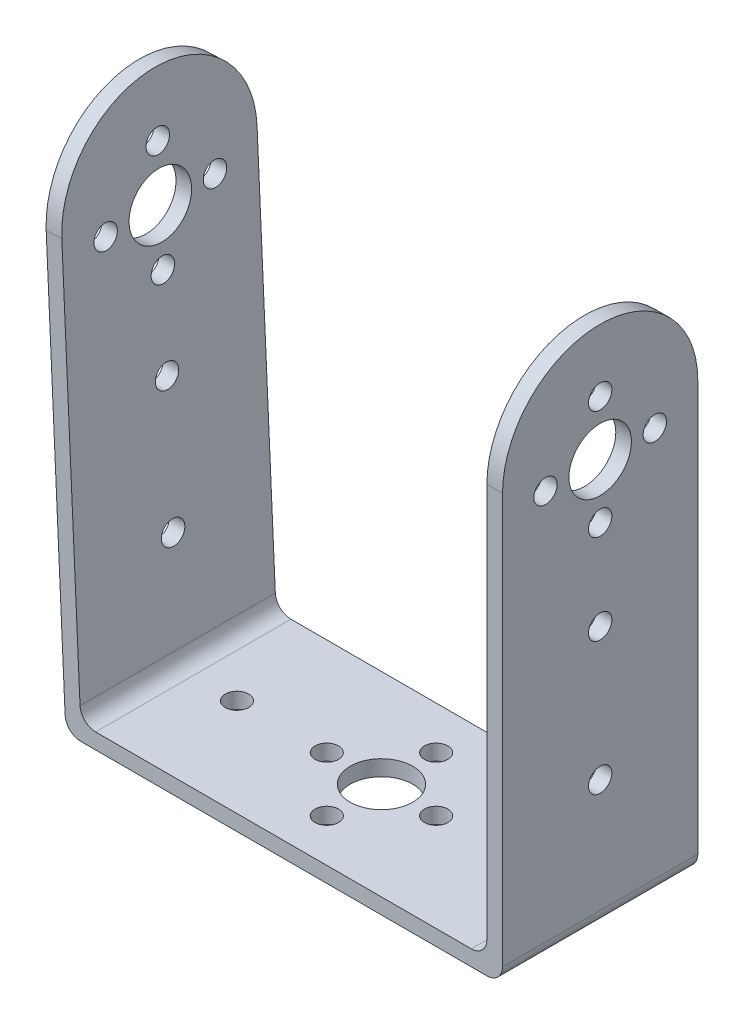
ISO-10303-21;
HEADER;
FILE_DESCRIPTION(('STEP AP214'),'2;1');
FILE_NAME('part.step','',(''),(''),'','','');
FILE_SCHEMA(('AUTOMOTIVE_DESIGN { 1 0 10303 214 1 1 1 1 }'));
ENDSEC;
DATA;
#1=APPLICATION_CONTEXT('core data for automotive mechanical design processes');
#2=APPLICATION_PROTOCOL_DEFINITION('international standard','automotive_design',2000,#1);
#3=PRODUCT_CONTEXT('',#1,'mechanical');
#4=PRODUCT('Part','Part','',(#3));
#5=PRODUCT_RELATED_PRODUCT_CATEGORY('part','',(#4));
#6=PRODUCT_DEFINITION_FORMATION('','',#4);
#7=PRODUCT_DEFINITION_CONTEXT('part definition',#1,'design');
#8=PRODUCT_DEFINITION('design','',#6,#7);
#9=PRODUCT_DEFINITION_SHAPE('','',#8);
#10=(LENGTH_UNIT() NAMED_UNIT(*) SI_UNIT(.MILLI.,.METRE.));
#11=(NAMED_UNIT(*) PLANE_ANGLE_UNIT() SI_UNIT($,.RADIAN.));
#12=(NAMED_UNIT(*) SI_UNIT($,.STERADIAN.) SOLID_ANGLE_UNIT());
#13=UNCERTAINTY_MEASURE_WITH_UNIT(LENGTH_MEASURE(1.E-05),#10,'distance_accuracy_value','');
#14=(GEOMETRIC_REPRESENTATION_CONTEXT(3) GLOBAL_UNCERTAINTY_ASSIGNED_CONTEXT((#13)) GLOBAL_UNIT_ASSIGNED_CONTEXT((#10,
#11,#12)) REPRESENTATION_CONTEXT('',''));
#15=CARTESIAN_POINT('',(0.,0.,0.));
#16=DIRECTION('',(0.,0.,1.));
#17=DIRECTION('',(1.,0.,0.));
#18=AXIS2_PLACEMENT_3D('',#15,#16,#17);
#19=CARTESIAN_POINT('',(25.999082785568,67.0000000000004,-25.));
#20=DIRECTION('',(-1.,0.,0.));
#21=DIRECTION('',(0.,-1.,0.));
#22=AXIS2_PLACEMENT_3D('',#19,#20,#21);
#23=PLANE('',#22);
#24=CARTESIAN_POINT('',(25.999082785568,52.,-5.5));
#25=DIRECTION('',(1.,0.,0.));
#26=DIRECTION('',(0.,0.,-1.));
#27=AXIS2_PLACEMENT_3D('',#24,#25,#26);
#28=CIRCLE('',#27,1.5);
#29=CARTESIAN_POINT('',(25.999082785568,52.,-7.));
#30=VERTEX_POINT('',#29);
#31=EDGE_CURVE('E625',#30,#30,#28,.T.);
#32=ORIENTED_EDGE('',*,*,#31,.T.);
#33=EDGE_LOOP('',(#32));
#34=FACE_BOUND('',#33,.T.);
#35=CARTESIAN_POINT('',(25.999082785568,33.5,-12.5));
#36=DIRECTION('',(1.,0.,0.));
#37=DIRECTION('',(0.,0.,-1.));
#38=AXIS2_PLACEMENT_3D('',#35,#36,#37);
#39=CIRCLE('',#38,1.5);
#40=CARTESIAN_POINT('',(25.999082785568,33.5,-14.));
#41=VERTEX_POINT('',#40);
#42=EDGE_CURVE('E631',#41,#41,#39,.T.);
#43=ORIENTED_EDGE('',*,*,#42,.T.);
#44=EDGE_LOOP('',(#43));
#45=FACE_BOUND('',#44,.T.);
#46=CARTESIAN_POINT('',(25.999082785568,16.5,-12.5));
#47=DIRECTION('',(1.,0.,0.));
#48=DIRECTION('',(0.,0.,-1.));
#49=AXIS2_PLACEMENT_3D('',#46,#47,#48);
#50=CIRCLE('',#49,1.5);
#51=CARTESIAN_POINT('',(25.999082785568,16.5,-14.));
#52=VERTEX_POINT('',#51);
#53=EDGE_CURVE('E613',#52,#52,#50,.T.);
#54=ORIENTED_EDGE('',*,*,#53,.T.);
#55=EDGE_LOOP('',(#54));
#56=FACE_BOUND('',#55,.T.);
#57=CARTESIAN_POINT('',(25.999082785568,52.,-12.5));
#58=DIRECTION('',(1.,0.,0.));
#59=DIRECTION('',(0.,0.,-1.));
#60=AXIS2_PLACEMENT_3D('',#57,#58,#59);
#61=CIRCLE('',#60,4.);
#62=CARTESIAN_POINT('',(25.999082785568,52.,-16.5));
#63=VERTEX_POINT('',#62);
#64=EDGE_CURVE('E620',#63,#63,#61,.T.);
#65=ORIENTED_EDGE('',*,*,#64,.T.);
#66=EDGE_LOOP('',(#65));
#67=FACE_BOUND('',#66,.T.);
#68=CARTESIAN_POINT('',(25.999082785568,45.,-12.4999999999999));
#69=DIRECTION('',(1.,0.,0.));
#70=DIRECTION('',(0.,0.,-1.));
#71=AXIS2_PLACEMENT_3D('',#68,#69,#70);
#72=CIRCLE('',#71,1.5);
#73=CARTESIAN_POINT('',(25.999082785568,45.,-13.9999999999999));
#74=VERTEX_POINT('',#73);
#75=EDGE_CURVE('E647',#74,#74,#72,.T.);
#76=ORIENTED_EDGE('',*,*,#75,.T.);
#77=EDGE_LOOP('',(#76));
#78=FACE_BOUND('',#77,.T.);
#79=CARTESIAN_POINT('',(25.999082785568,52.,-19.5));
#80=DIRECTION('',(1.,0.,0.));
#81=DIRECTION('',(0.,0.,-1.));
#82=AXIS2_PLACEMENT_3D('',#79,#80,#81);
#83=CIRCLE('',#82,1.5);
#84=CARTESIAN_POINT('',(25.999082785568,52.,-21.));
#85=VERTEX_POINT('',#84);
#86=EDGE_CURVE('E640',#85,#85,#83,.T.);
#87=ORIENTED_EDGE('',*,*,#86,.T.);
#88=EDGE_LOOP('',(#87));
#89=FACE_BOUND('',#88,.T.);
#90=CARTESIAN_POINT('',(25.999082785568,59.,-12.5));
#91=DIRECTION('',(1.,0.,0.));
#92=DIRECTION('',(0.,0.,-1.));
#93=AXIS2_PLACEMENT_3D('',#90,#91,#92);
#94=CIRCLE('',#93,1.5);
#95=CARTESIAN_POINT('',(25.999082785568,59.,-14.));
#96=VERTEX_POINT('',#95);
#97=EDGE_CURVE('E259',#96,#96,#94,.T.);
#98=ORIENTED_EDGE('',*,*,#97,.T.);
#99=EDGE_LOOP('',(#98));
#100=FACE_BOUND('',#99,.T.);
#101=DIRECTION('',(0.,-1.,0.));
#102=VECTOR('',#101,1.);
#103=CARTESIAN_POINT('',(25.999082785568,67.0000000000004,-25.));
#104=LINE('',#103,#102);
#105=CARTESIAN_POINT('',(25.999082785568,54.5,-25.));
#106=VERTEX_POINT('',#105);
#107=CARTESIAN_POINT('',(25.999082785568,4.,-25.));
#108=VERTEX_POINT('',#107);
#109=EDGE_CURVE('E243',#106,#108,#104,.T.);
#110=ORIENTED_EDGE('',*,*,#109,.T.);
#111=DIRECTION('',(0.,0.,1.));
#112=VECTOR('',#111,1.);
#113=CARTESIAN_POINT('',(25.999082785568,4.,0.));
#114=LINE('',#113,#112);
#115=CARTESIAN_POINT('',(25.999082785568,4.,0.));
#116=VERTEX_POINT('',#115);
#117=EDGE_CURVE('E314',#108,#116,#114,.T.);
#118=ORIENTED_EDGE('',*,*,#117,.T.);
#119=DIRECTION('',(0.,-1.,0.));
#120=VECTOR('',#119,1.);
#121=CARTESIAN_POINT('',(25.999082785568,67.0000000000004,0.));
#122=LINE('',#121,#120);
#123=CARTESIAN_POINT('',(25.999082785568,54.5,0.));
#124=VERTEX_POINT('',#123);
#125=EDGE_CURVE('E246',#124,#116,#122,.T.);
#126=ORIENTED_EDGE('',*,*,#125,.F.);
#127=CARTESIAN_POINT('',(25.999082785568,54.5,-12.5));
#128=DIRECTION('',(1.,0.,0.));
#129=DIRECTION('',(0.,0.,-1.));
#130=AXIS2_PLACEMENT_3D('',#127,#128,#129);
#131=CIRCLE('',#130,12.5);
#132=EDGE_CURVE('E239',#106,#124,#131,.T.);
#133=ORIENTED_EDGE('',*,*,#132,.F.);
#134=EDGE_LOOP('',(#110,#118,#126,#133));
#135=FACE_BOUND('',#134,.T.);
#136=ADVANCED_FACE('F149',(#34,#45,#56,#67,#78,#89,#100,#135),#23,.T.);
#137=CARTESIAN_POINT('',(27.999082785568,67.,-25.));
#138=DIRECTION('',(1.,0.,0.));
#139=DIRECTION('',(0.,0.,-1.));
#140=AXIS2_PLACEMENT_3D('',#137,#138,#139);
#141=PLANE('',#140);
#142=CARTESIAN_POINT('',(27.999082785568,52.,-5.5));
#143=DIRECTION('',(1.,0.,0.));
#144=DIRECTION('',(0.,0.,-1.));
#145=AXIS2_PLACEMENT_3D('',#142,#143,#144);
#146=CIRCLE('',#145,1.5);
#147=CARTESIAN_POINT('',(27.999082785568,52.,-7.));
#148=VERTEX_POINT('',#147);
#149=EDGE_CURVE('E628',#148,#148,#146,.T.);
#150=ORIENTED_EDGE('',*,*,#149,.F.);
#151=EDGE_LOOP('',(#150));
#152=FACE_BOUND('',#151,.T.);
#153=CARTESIAN_POINT('',(27.999082785568,33.5,-12.5));
#154=DIRECTION('',(1.,0.,0.));
#155=DIRECTION('',(0.,0.,-1.));
#156=AXIS2_PLACEMENT_3D('',#153,#154,#155);
#157=CIRCLE('',#156,1.5);
#158=CARTESIAN_POINT('',(27.999082785568,33.5,-14.));
#159=VERTEX_POINT('',#158);
#160=EDGE_CURVE('E616',#159,#159,#157,.T.);
#161=ORIENTED_EDGE('',*,*,#160,.F.);
#162=EDGE_LOOP('',(#161));
#163=FACE_BOUND('',#162,.T.);
#164=CARTESIAN_POINT('',(27.999082785568,16.5,-12.5));
#165=DIRECTION('',(1.,0.,0.));
#166=DIRECTION('',(0.,0.,-1.));
#167=AXIS2_PLACEMENT_3D('',#164,#165,#166);
#168=CIRCLE('',#167,1.5);
#169=CARTESIAN_POINT('',(27.999082785568,16.5,-14.));
#170=VERTEX_POINT('',#169);
#171=EDGE_CURVE('E617',#170,#170,#168,.T.);
#172=ORIENTED_EDGE('',*,*,#171,.F.);
#173=EDGE_LOOP('',(#172));
#174=FACE_BOUND('',#173,.T.);
#175=CARTESIAN_POINT('',(27.999082785568,52.,-12.5));
#176=DIRECTION('',(1.,0.,0.));
#177=DIRECTION('',(0.,0.,-1.));
#178=AXIS2_PLACEMENT_3D('',#175,#176,#177);
#179=CIRCLE('',#178,4.);
#180=CARTESIAN_POINT('',(27.999082785568,52.,-16.5));
#181=VERTEX_POINT('',#180);
#182=EDGE_CURVE('E610',#181,#181,#179,.T.);
#183=ORIENTED_EDGE('',*,*,#182,.F.);
#184=EDGE_LOOP('',(#183));
#185=FACE_BOUND('',#184,.T.);
#186=CARTESIAN_POINT('',(27.999082785568,45.,-12.4999999999999));
#187=DIRECTION('',(1.,0.,0.));
#188=DIRECTION('',(0.,0.,-1.));
#189=AXIS2_PLACEMENT_3D('',#186,#187,#188);
#190=CIRCLE('',#189,1.5);
#191=CARTESIAN_POINT('',(27.999082785568,45.,-13.9999999999999));
#192=VERTEX_POINT('',#191);
#193=EDGE_CURVE('E627',#192,#192,#190,.T.);
#194=ORIENTED_EDGE('',*,*,#193,.F.);
#195=EDGE_LOOP('',(#194));
#196=FACE_BOUND('',#195,.T.);
#197=CARTESIAN_POINT('',(27.999082785568,52.,-19.5));
#198=DIRECTION('',(1.,0.,0.));
#199=DIRECTION('',(0.,0.,-1.));
#200=AXIS2_PLACEMENT_3D('',#197,#198,#199);
#201=CIRCLE('',#200,1.5);
#202=CARTESIAN_POINT('',(27.999082785568,52.,-21.));
#203=VERTEX_POINT('',#202);
#204=EDGE_CURVE('E644',#203,#203,#201,.T.);
#205=ORIENTED_EDGE('',*,*,#204,.F.);
#206=EDGE_LOOP('',(#205));
#207=FACE_BOUND('',#206,.T.);
#208=CARTESIAN_POINT('',(27.999082785568,59.,-12.5));
#209=DIRECTION('',(1.,0.,0.));
#210=DIRECTION('',(0.,0.,-1.));
#211=AXIS2_PLACEMENT_3D('',#208,#209,#210);
#212=CIRCLE('',#211,1.5);
#213=CARTESIAN_POINT('',(27.999082785568,59.,-14.));
#214=VERTEX_POINT('',#213);
#215=EDGE_CURVE('E638',#214,#214,#212,.T.);
#216=ORIENTED_EDGE('',*,*,#215,.F.);
#217=EDGE_LOOP('',(#216));
#218=FACE_BOUND('',#217,.T.);
#219=DIRECTION('',(0.,1.,0.));
#220=VECTOR('',#219,1.);
#221=CARTESIAN_POINT('',(27.999082785568,67.,0.));
#222=LINE('',#221,#220);
#223=CARTESIAN_POINT('',(27.999082785568,2.,0.));
#224=VERTEX_POINT('',#223);
#225=CARTESIAN_POINT('',(27.999082785568,54.5,0.));
#226=VERTEX_POINT('',#225);
#227=EDGE_CURVE('E281',#224,#226,#222,.T.);
#228=ORIENTED_EDGE('',*,*,#227,.F.);
#229=DIRECTION('',(0.,0.,1.));
#230=VECTOR('',#229,1.);
#231=CARTESIAN_POINT('',(27.999082785568,2.,-25.));
#232=LINE('',#231,#230);
#233=CARTESIAN_POINT('',(27.999082785568,2.,-25.));
#234=VERTEX_POINT('',#233);
#235=EDGE_CURVE('E316',#224,#234,#232,.F.);
#236=ORIENTED_EDGE('',*,*,#235,.T.);
#237=DIRECTION('',(0.,1.,0.));
#238=VECTOR('',#237,1.);
#239=CARTESIAN_POINT('',(27.999082785568,67.,-25.));
#240=LINE('',#239,#238);
#241=CARTESIAN_POINT('',(27.999082785568,54.5,-25.));
#242=VERTEX_POINT('',#241);
#243=EDGE_CURVE('E265',#234,#242,#240,.T.);
#244=ORIENTED_EDGE('',*,*,#243,.T.);
#245=CARTESIAN_POINT('',(27.999082785568,54.5,-12.5));
#246=DIRECTION('',(1.,0.,0.));
#247=DIRECTION('',(0.,0.,-1.));
#248=AXIS2_PLACEMENT_3D('',#245,#246,#247);
#249=CIRCLE('',#248,12.5);
#250=EDGE_CURVE('E251',#242,#226,#249,.T.);
#251=ORIENTED_EDGE('',*,*,#250,.T.);
#252=EDGE_LOOP('',(#228,#236,#244,#251));
#253=FACE_BOUND('',#252,.T.);
#254=ADVANCED_FACE('F337',(#152,#163,#174,#185,#196,#207,#218,#253),#141,.T.);
#255=CARTESIAN_POINT('',(0.,0.,-25.));
#256=DIRECTION('',(0.,0.,-1.));
#257=DIRECTION('',(-1.,0.,0.));
#258=AXIS2_PLACEMENT_3D('',#255,#256,#257);
#259=PLANE('',#258);
#260=DIRECTION('',(1.,0.,0.));
#261=VECTOR('',#260,1.);
#262=CARTESIAN_POINT('',(-27.9107385664314,0.,-25.));
#263=LINE('',#262,#261);
#264=CARTESIAN_POINT('',(-26.0009172144317,0.,-25.));
#265=VERTEX_POINT('',#264);
#266=CARTESIAN_POINT('',(25.999082785568,1.32373910591952E-13,-25.));
#267=VERTEX_POINT('',#266);
#268=EDGE_CURVE('E269',#265,#267,#263,.T.);
#269=ORIENTED_EDGE('',*,*,#268,.F.);
#270=CARTESIAN_POINT('',(-26.0009172144317,2.,-25.));
#271=DIRECTION('',(0.,0.,-1.));
#272=DIRECTION('',(-1.,0.,0.));
#273=AXIS2_PLACEMENT_3D('',#270,#271,#272);
#274=CIRCLE('',#273,2.);
#275=CARTESIAN_POINT('',(-27.9987904341291,1.90779046678319,-25.));
#276=VERTEX_POINT('',#275);
#277=EDGE_CURVE('E306',#265,#276,#274,.T.);
#278=ORIENTED_EDGE('',*,*,#277,.T.);
#279=DIRECTION('',(0.0461047666084067,-0.998936609848685,0.));
#280=VECTOR('',#279,1.);
#281=CARTESIAN_POINT('',(-30.9987904341294,66.9077904667816,-25.));
#282=LINE('',#281,#280);
#283=CARTESIAN_POINT('',(-30.4224808515243,54.4210828436731,-25.));
#284=VERTEX_POINT('',#283);
#285=EDGE_CURVE('E274',#284,#276,#282,.T.);
#286=ORIENTED_EDGE('',*,*,#285,.F.);
#287=DIRECTION('',(-0.998936609848685,-0.0461047666084067,0.));
#288=VECTOR('',#287,1.);
#289=CARTESIAN_POINT('',(-28.424607631827,54.5132923768899,-25.));
#290=LINE('',#289,#288);
#291=CARTESIAN_POINT('',(-28.424607631827,54.5132923768899,-25.));
#292=VERTEX_POINT('',#291);
#293=EDGE_CURVE('E379',#292,#284,#290,.T.);
#294=ORIENTED_EDGE('',*,*,#293,.F.);
#295=DIRECTION('',(-0.0461047666084023,0.998936609848685,0.));
#296=VECTOR('',#295,1.);
#297=CARTESIAN_POINT('',(-26.000917214432,1.99999999999999,-25.));
#298=LINE('',#297,#296);
#299=CARTESIAN_POINT('',(-26.0889690821297,3.90779046678319,-25.));
#300=VERTEX_POINT('',#299);
#301=EDGE_CURVE('E267',#300,#292,#298,.T.);
#302=ORIENTED_EDGE('',*,*,#301,.F.);
#303=CARTESIAN_POINT('',(-24.0910958624323,3.99999999999999,-25.));
#304=DIRECTION('',(0.,0.,-1.));
#305=DIRECTION('',(-1.,0.,0.));
#306=AXIS2_PLACEMENT_3D('',#303,#304,#305);
#307=CIRCLE('',#306,2.);
#308=CARTESIAN_POINT('',(-24.0910958624323,1.99999999999999,-25.));
#309=VERTEX_POINT('',#308);
#310=EDGE_CURVE('E164',#300,#309,#307,.F.);
#311=ORIENTED_EDGE('',*,*,#310,.T.);
#312=DIRECTION('',(-1.,0.,0.));
#313=VECTOR('',#312,1.);
#314=CARTESIAN_POINT('',(25.999082785568,2.,-25.));
#315=LINE('',#314,#313);
#316=CARTESIAN_POINT('',(23.999082785568,2.,-25.));
#317=VERTEX_POINT('',#316);
#318=EDGE_CURVE('E264',#317,#309,#315,.T.);
#319=ORIENTED_EDGE('',*,*,#318,.F.);
#320=CARTESIAN_POINT('',(23.999082785568,4.,-25.));
#321=DIRECTION('',(0.,0.,-1.));
#322=DIRECTION('',(-1.,0.,0.));
#323=AXIS2_PLACEMENT_3D('',#320,#321,#322);
#324=CIRCLE('',#323,2.);
#325=EDGE_CURVE('E12',#317,#108,#324,.F.);
#326=ORIENTED_EDGE('',*,*,#325,.T.);
#327=ORIENTED_EDGE('',*,*,#109,.F.);
#328=DIRECTION('',(1.,0.,0.));
#329=VECTOR('',#328,1.);
#330=CARTESIAN_POINT('',(25.999082785568,54.5,-25.));
#331=LINE('',#330,#329);
#332=EDGE_CURVE('E255',#106,#242,#331,.T.);
#333=ORIENTED_EDGE('',*,*,#332,.T.);
#334=ORIENTED_EDGE('',*,*,#243,.F.);
#335=CARTESIAN_POINT('',(25.999082785568,2.,-25.));
#336=DIRECTION('',(0.,0.,-1.));
#337=DIRECTION('',(-1.,0.,0.));
#338=AXIS2_PLACEMENT_3D('',#335,#336,#337);
#339=CIRCLE('',#338,2.);
#340=EDGE_CURVE('E304',#234,#267,#339,.T.);
#341=ORIENTED_EDGE('',*,*,#340,.T.);
#342=EDGE_LOOP('',(#269,#278,#286,#294,#302,#311,#319,#326,#327,#333,#334,#341));
#343=FACE_BOUND('',#342,.T.);
#344=ADVANCED_FACE('F262',(#343),#259,.T.);
#345=CARTESIAN_POINT('',(0.,0.,0.));
#346=DIRECTION('',(0.,0.,-1.));
#347=DIRECTION('',(-1.,0.,0.));
#348=AXIS2_PLACEMENT_3D('',#345,#346,#347);
#349=PLANE('',#348);
#350=DIRECTION('',(0.0461047666084067,-0.998936609848685,0.));
#351=VECTOR('',#350,1.);
#352=CARTESIAN_POINT('',(-30.9987904341294,66.9077904667816,0.));
#353=LINE('',#352,#351);
#354=CARTESIAN_POINT('',(-30.4224808515243,54.4210828436731,0.));
#355=VERTEX_POINT('',#354);
#356=CARTESIAN_POINT('',(-27.9987904341291,1.90779046678319,0.));
#357=VERTEX_POINT('',#356);
#358=EDGE_CURVE('E290',#355,#357,#353,.T.);
#359=ORIENTED_EDGE('',*,*,#358,.T.);
#360=CARTESIAN_POINT('',(-26.0009172144317,2.,0.));
#361=DIRECTION('',(0.,0.,-1.));
#362=DIRECTION('',(-1.,0.,0.));
#363=AXIS2_PLACEMENT_3D('',#360,#361,#362);
#364=CIRCLE('',#363,2.);
#365=CARTESIAN_POINT('',(-26.0009172144317,0.,0.));
#366=VERTEX_POINT('',#365);
#367=EDGE_CURVE('E297',#357,#366,#364,.F.);
#368=ORIENTED_EDGE('',*,*,#367,.T.);
#369=DIRECTION('',(1.,0.,0.));
#370=VECTOR('',#369,1.);
#371=CARTESIAN_POINT('',(27.999082785568,0.,0.));
#372=LINE('',#371,#370);
#373=CARTESIAN_POINT('',(25.999082785568,0.,0.));
#374=VERTEX_POINT('',#373);
#375=EDGE_CURVE('E278',#366,#374,#372,.T.);
#376=ORIENTED_EDGE('',*,*,#375,.T.);
#377=CARTESIAN_POINT('',(25.999082785568,2.,0.));
#378=DIRECTION('',(0.,0.,-1.));
#379=DIRECTION('',(-1.,0.,0.));
#380=AXIS2_PLACEMENT_3D('',#377,#378,#379);
#381=CIRCLE('',#380,2.);
#382=EDGE_CURVE('E295',#374,#224,#381,.F.);
#383=ORIENTED_EDGE('',*,*,#382,.T.);
#384=ORIENTED_EDGE('',*,*,#227,.T.);
#385=DIRECTION('',(1.,0.,0.));
#386=VECTOR('',#385,1.);
#387=CARTESIAN_POINT('',(25.999082785568,54.5,0.));
#388=LINE('',#387,#386);
#389=EDGE_CURVE('E250',#124,#226,#388,.T.);
#390=ORIENTED_EDGE('',*,*,#389,.F.);
#391=ORIENTED_EDGE('',*,*,#125,.T.);
#392=CARTESIAN_POINT('',(23.999082785568,4.,0.));
#393=DIRECTION('',(0.,0.,-1.));
#394=DIRECTION('',(-1.,0.,0.));
#395=AXIS2_PLACEMENT_3D('',#392,#393,#394);
#396=CIRCLE('',#395,2.);
#397=CARTESIAN_POINT('',(23.999082785568,2.,0.));
#398=VERTEX_POINT('',#397);
#399=EDGE_CURVE('E157',#116,#398,#396,.T.);
#400=ORIENTED_EDGE('',*,*,#399,.T.);
#401=DIRECTION('',(-1.,0.,0.));
#402=VECTOR('',#401,1.);
#403=CARTESIAN_POINT('',(25.999082785568,2.,0.));
#404=LINE('',#403,#402);
#405=CARTESIAN_POINT('',(-24.0910958624323,1.99999999999999,0.));
#406=VERTEX_POINT('',#405);
#407=EDGE_CURVE('E285',#398,#406,#404,.T.);
#408=ORIENTED_EDGE('',*,*,#407,.T.);
#409=CARTESIAN_POINT('',(-24.0910958624323,3.99999999999999,0.));
#410=DIRECTION('',(0.,0.,-1.));
#411=DIRECTION('',(-1.,0.,0.));
#412=AXIS2_PLACEMENT_3D('',#409,#410,#411);
#413=CIRCLE('',#412,2.);
#414=CARTESIAN_POINT('',(-26.0889690821297,3.90779046678319,0.));
#415=VERTEX_POINT('',#414);
#416=EDGE_CURVE('E318',#406,#415,#413,.T.);
#417=ORIENTED_EDGE('',*,*,#416,.T.);
#418=DIRECTION('',(-0.0461047666084023,0.998936609848685,0.));
#419=VECTOR('',#418,1.);
#420=CARTESIAN_POINT('',(-26.000917214432,1.99999999999999,0.));
#421=LINE('',#420,#419);
#422=CARTESIAN_POINT('',(-28.424607631827,54.5132923768899,0.));
#423=VERTEX_POINT('',#422);
#424=EDGE_CURVE('E288',#415,#423,#421,.T.);
#425=ORIENTED_EDGE('',*,*,#424,.T.);
#426=DIRECTION('',(-0.998936609848685,-0.0461047666084067,0.));
#427=VECTOR('',#426,1.);
#428=CARTESIAN_POINT('',(-28.424607631827,54.5132923768899,0.));
#429=LINE('',#428,#427);
#430=EDGE_CURVE('E282',#423,#355,#429,.T.);
#431=ORIENTED_EDGE('',*,*,#430,.T.);
#432=EDGE_LOOP('',(#359,#368,#376,#383,#384,#390,#391,#400,#408,#417,#425,#431));
#433=FACE_BOUND('',#432,.T.);
#434=ADVANCED_FACE('F321',(#433),#349,.F.);
#435=CARTESIAN_POINT('',(-30.9987904341294,66.9077904667816,-25.));
#436=DIRECTION('',(-0.998936609848685,-0.0461047666084067,0.));
#437=DIRECTION('',(0.0461047666084067,-0.998936609848685,0.));
#438=AXIS2_PLACEMENT_3D('',#435,#436,#437);
#439=PLANE('',#438);
#440=CARTESIAN_POINT('',(-30.6309197963274,58.9372599810724,-12.4999999999999));
#441=DIRECTION('',(-0.998936609848685,-0.0461047666084067,0.));
#442=DIRECTION('',(0.0461047666084067,-0.998936609848685,0.));
#443=AXIS2_PLACEMENT_3D('',#440,#441,#442);
#444=CIRCLE('',#443,1.5);
#445=CARTESIAN_POINT('',(-30.5617626464148,57.4388550662994,-12.4999999999999));
#446=VERTEX_POINT('',#445);
#447=EDGE_CURVE('E406',#446,#446,#444,.T.);
#448=ORIENTED_EDGE('',*,*,#447,.F.);
#449=EDGE_LOOP('',(#448));
#450=FACE_BOUND('',#449,.T.);
#451=CARTESIAN_POINT('',(-30.3081864300686,51.9447037121315,-5.50000000000001));
#452=DIRECTION('',(-0.998936609848685,-0.0461047666084067,0.));
#453=DIRECTION('',(0.0461047666084067,-0.998936609848685,0.));
#454=AXIS2_PLACEMENT_3D('',#451,#452,#453);
#455=CIRCLE('',#454,1.5);
#456=CARTESIAN_POINT('',(-30.2390292801559,50.4462987973585,-5.50000000000001));
#457=VERTEX_POINT('',#456);
#458=EDGE_CURVE('E435',#457,#457,#455,.T.);
#459=ORIENTED_EDGE('',*,*,#458,.F.);
#460=EDGE_LOOP('',(#459));
#461=FACE_BOUND('',#460,.T.);
#462=CARTESIAN_POINT('',(-30.3081864300685,51.9447037121316,-12.5));
#463=DIRECTION('',(-0.998936609848685,-0.0461047666084067,0.));
#464=DIRECTION('',(0.0461047666084067,-0.998936609848685,0.));
#465=AXIS2_PLACEMENT_3D('',#462,#463,#464);
#466=CIRCLE('',#465,4.);
#467=CARTESIAN_POINT('',(-30.1237673636349,47.9489572727369,-12.5));
#468=VERTEX_POINT('',#467);
#469=EDGE_CURVE('E420',#468,#468,#466,.T.);
#470=ORIENTED_EDGE('',*,*,#469,.F.);
#471=EDGE_LOOP('',(#470));
#472=FACE_BOUND('',#471,.T.);
#473=CARTESIAN_POINT('',(-30.3081864300685,51.9447037121316,-19.5));
#474=DIRECTION('',(-0.998936609848685,-0.0461047666084067,0.));
#475=DIRECTION('',(0.0461047666084067,-0.998936609848685,0.));
#476=AXIS2_PLACEMENT_3D('',#473,#474,#475);
#477=CIRCLE('',#476,1.5);
#478=CARTESIAN_POINT('',(-30.2390292801559,50.4462987973586,-19.5));
#479=VERTEX_POINT('',#478);
#480=EDGE_CURVE('E426',#479,#479,#477,.T.);
#481=ORIENTED_EDGE('',*,*,#480,.F.);
#482=EDGE_LOOP('',(#481));
#483=FACE_BOUND('',#482,.T.);
#484=CARTESIAN_POINT('',(-28.6714672154701,16.4824540625033,-12.5));
#485=DIRECTION('',(-0.998936609848685,-0.0461047666084067,0.));
#486=DIRECTION('',(0.0461047666084067,-0.998936609848685,0.));
#487=AXIS2_PLACEMENT_3D('',#484,#485,#486);
#488=CIRCLE('',#487,1.5);
#489=CARTESIAN_POINT('',(-28.6023100655575,14.9840491477303,-12.5));
#490=VERTEX_POINT('',#489);
#491=EDGE_CURVE('E400',#490,#490,#488,.T.);
#492=ORIENTED_EDGE('',*,*,#491,.F.);
#493=EDGE_LOOP('',(#492));
#494=FACE_BOUND('',#493,.T.);
#495=CARTESIAN_POINT('',(-29.455248247813,33.464376429931,-12.5));
#496=DIRECTION('',(-0.998936609848685,-0.0461047666084067,0.));
#497=DIRECTION('',(0.0461047666084067,-0.998936609848685,0.));
#498=AXIS2_PLACEMENT_3D('',#495,#496,#497);
#499=CIRCLE('',#498,1.5);
#500=CARTESIAN_POINT('',(-29.3860910979004,31.9659715151579,-12.5));
#501=VERTEX_POINT('',#500);
#502=EDGE_CURVE('E394',#501,#501,#499,.T.);
#503=ORIENTED_EDGE('',*,*,#502,.F.);
#504=EDGE_LOOP('',(#503));
#505=FACE_BOUND('',#504,.T.);
#506=CARTESIAN_POINT('',(-29.9854530638097,44.9521474431908,-12.5));
#507=DIRECTION('',(-0.998936609848685,-0.0461047666084067,0.));
#508=DIRECTION('',(0.0461047666084067,-0.998936609848685,0.));
#509=AXIS2_PLACEMENT_3D('',#506,#507,#508);
#510=CIRCLE('',#509,1.5);
#511=CARTESIAN_POINT('',(-29.9162959138971,43.4537425284178,-12.5));
#512=VERTEX_POINT('',#511);
#513=EDGE_CURVE('E383',#512,#512,#510,.T.);
#514=ORIENTED_EDGE('',*,*,#513,.F.);
#515=EDGE_LOOP('',(#514));
#516=FACE_BOUND('',#515,.T.);
#517=ORIENTED_EDGE('',*,*,#285,.T.);
#518=DIRECTION('',(0.,0.,1.));
#519=VECTOR('',#518,1.);
#520=CARTESIAN_POINT('',(-27.9987904341291,1.9077904667832,-25.));
#521=LINE('',#520,#519);
#522=EDGE_CURVE('E277',#276,#357,#521,.T.);
#523=ORIENTED_EDGE('',*,*,#522,.T.);
#524=ORIENTED_EDGE('',*,*,#358,.F.);
#525=CARTESIAN_POINT('',(-30.4224808515243,54.4210828436731,-12.5));
#526=DIRECTION('',(-0.998936609848685,-0.0461047666084067,0.));
#527=DIRECTION('',(0.0461047666084067,-0.998936609848685,0.));
#528=AXIS2_PLACEMENT_3D('',#525,#526,#527);
#529=CIRCLE('',#528,12.5);
#530=EDGE_CURVE('E373',#355,#284,#529,.T.);
#531=ORIENTED_EDGE('',*,*,#530,.T.);
#532=EDGE_LOOP('',(#517,#523,#524,#531));
#533=FACE_BOUND('',#532,.T.);
#534=ADVANCED_FACE('F371',(#450,#461,#472,#483,#494,#505,#516,#533),#439,.T.);
#535=CARTESIAN_POINT('',(-26.000917214432,1.99999999999999,-25.));
#536=DIRECTION('',(0.998936609848685,0.0461047666084023,0.));
#537=DIRECTION('',(-0.0461047666084023,0.998936609848686,0.));
#538=AXIS2_PLACEMENT_3D('',#535,#536,#537);
#539=PLANE('',#538);
#540=CARTESIAN_POINT('',(-28.63304657663,59.0294695142892,-12.4999999999999));
#541=DIRECTION('',(-0.998936609848685,-0.0461047666084067,0.));
#542=DIRECTION('',(0.0461047666084067,-0.998936609848685,0.));
#543=AXIS2_PLACEMENT_3D('',#540,#541,#542);
#544=CIRCLE('',#543,1.5);
#545=CARTESIAN_POINT('',(-28.5638894267174,57.5310645995162,-12.4999999999999));
#546=VERTEX_POINT('',#545);
#547=EDGE_CURVE('E433',#546,#546,#544,.T.);
#548=ORIENTED_EDGE('',*,*,#547,.T.);
#549=EDGE_LOOP('',(#548));
#550=FACE_BOUND('',#549,.T.);
#551=CARTESIAN_POINT('',(-28.3103132103712,52.0369132453484,-5.50000000000001));
#552=DIRECTION('',(-0.998936609848685,-0.0461047666084067,0.));
#553=DIRECTION('',(0.0461047666084067,-0.998936609848685,0.));
#554=AXIS2_PLACEMENT_3D('',#551,#552,#553);
#555=CIRCLE('',#554,1.5);
#556=CARTESIAN_POINT('',(-28.2411560604586,50.5385083305753,-5.50000000000001));
#557=VERTEX_POINT('',#556);
#558=EDGE_CURVE('E389',#557,#557,#555,.T.);
#559=ORIENTED_EDGE('',*,*,#558,.T.);
#560=EDGE_LOOP('',(#559));
#561=FACE_BOUND('',#560,.T.);
#562=CARTESIAN_POINT('',(-28.3103132103712,52.0369132453484,-12.5));
#563=DIRECTION('',(-0.998936609848685,-0.0461047666084067,0.));
#564=DIRECTION('',(0.0461047666084067,-0.998936609848685,0.));
#565=AXIS2_PLACEMENT_3D('',#562,#563,#564);
#566=CIRCLE('',#565,4.);
#567=CARTESIAN_POINT('',(-28.1258941439375,48.0411668059537,-12.5));
#568=VERTEX_POINT('',#567);
#569=EDGE_CURVE('E423',#568,#568,#566,.T.);
#570=ORIENTED_EDGE('',*,*,#569,.T.);
#571=EDGE_LOOP('',(#570));
#572=FACE_BOUND('',#571,.T.);
#573=CARTESIAN_POINT('',(-28.3103132103712,52.0369132453485,-19.5));
#574=DIRECTION('',(-0.998936609848685,-0.0461047666084067,0.));
#575=DIRECTION('',(0.0461047666084067,-0.998936609848685,0.));
#576=AXIS2_PLACEMENT_3D('',#573,#574,#575);
#577=CIRCLE('',#576,1.5);
#578=CARTESIAN_POINT('',(-28.2411560604586,50.5385083305754,-19.5));
#579=VERTEX_POINT('',#578);
#580=EDGE_CURVE('E419',#579,#579,#577,.T.);
#581=ORIENTED_EDGE('',*,*,#580,.T.);
#582=EDGE_LOOP('',(#581));
#583=FACE_BOUND('',#582,.T.);
#584=CARTESIAN_POINT('',(-26.6735939957727,16.5746635957201,-12.5));
#585=DIRECTION('',(-0.998936609848685,-0.0461047666084067,0.));
#586=DIRECTION('',(0.0461047666084067,-0.998936609848685,0.));
#587=AXIS2_PLACEMENT_3D('',#584,#585,#586);
#588=CIRCLE('',#587,1.5);
#589=CARTESIAN_POINT('',(-26.6044368458601,15.0762586809471,-12.5));
#590=VERTEX_POINT('',#589);
#591=EDGE_CURVE('E403',#590,#590,#588,.T.);
#592=ORIENTED_EDGE('',*,*,#591,.T.);
#593=EDGE_LOOP('',(#592));
#594=FACE_BOUND('',#593,.T.);
#595=CARTESIAN_POINT('',(-27.4573750281157,33.5565859631478,-12.5));
#596=DIRECTION('',(-0.998936609848685,-0.0461047666084067,0.));
#597=DIRECTION('',(0.0461047666084067,-0.998936609848685,0.));
#598=AXIS2_PLACEMENT_3D('',#595,#596,#597);
#599=CIRCLE('',#598,1.5);
#600=CARTESIAN_POINT('',(-27.388217878203,32.0581810483747,-12.5));
#601=VERTEX_POINT('',#600);
#602=EDGE_CURVE('E397',#601,#601,#599,.T.);
#603=ORIENTED_EDGE('',*,*,#602,.T.);
#604=EDGE_LOOP('',(#603));
#605=FACE_BOUND('',#604,.T.);
#606=CARTESIAN_POINT('',(-27.9875798441123,45.0443569764076,-12.5));
#607=DIRECTION('',(-0.998936609848685,-0.0461047666084067,0.));
#608=DIRECTION('',(0.0461047666084067,-0.998936609848685,0.));
#609=AXIS2_PLACEMENT_3D('',#606,#607,#608);
#610=CIRCLE('',#609,1.5);
#611=CARTESIAN_POINT('',(-27.9184226941997,43.5459520616346,-12.5));
#612=VERTEX_POINT('',#611);
#613=EDGE_CURVE('E386',#612,#612,#610,.T.);
#614=ORIENTED_EDGE('',*,*,#613,.T.);
#615=EDGE_LOOP('',(#614));
#616=FACE_BOUND('',#615,.T.);
#617=ORIENTED_EDGE('',*,*,#424,.F.);
#618=DIRECTION('',(0.,0.,1.));
#619=VECTOR('',#618,1.);
#620=CARTESIAN_POINT('',(-26.0889690821297,3.90779046678319,-25.));
#621=LINE('',#620,#619);
#622=EDGE_CURVE('E312',#415,#300,#621,.F.);
#623=ORIENTED_EDGE('',*,*,#622,.T.);
#624=ORIENTED_EDGE('',*,*,#301,.T.);
#625=CARTESIAN_POINT('',(-28.424607631827,54.5132923768899,-12.5));
#626=DIRECTION('',(-0.998936609848685,-0.0461047666084067,0.));
#627=DIRECTION('',(0.0461047666084067,-0.998936609848685,0.));
#628=AXIS2_PLACEMENT_3D('',#625,#626,#627);
#629=CIRCLE('',#628,12.5);
#630=EDGE_CURVE('E378',#423,#292,#629,.T.);
#631=ORIENTED_EDGE('',*,*,#630,.F.);
#632=EDGE_LOOP('',(#617,#623,#624,#631));
#633=FACE_BOUND('',#632,.T.);
#634=ADVANCED_FACE('F442',(#550,#561,#572,#583,#594,#605,#616,#633),#539,.T.);
#635=CARTESIAN_POINT('',(25.999082785568,2.,-25.));
#636=DIRECTION('',(0.,1.,0.));
#637=DIRECTION('',(-1.,0.,0.));
#638=AXIS2_PLACEMENT_3D('',#635,#636,#637);
#639=PLANE('',#638);
#640=CARTESIAN_POINT('',(-0.00091721443200484,2.,-5.50000000000001));
#641=DIRECTION('',(0.,1.,0.));
#642=DIRECTION('',(-1.,0.,0.));
#643=AXIS2_PLACEMENT_3D('',#640,#641,#642);
#644=CIRCLE('',#643,1.5);
#645=CARTESIAN_POINT('',(-1.50091721443201,2.,-5.50000000000001));
#646=VERTEX_POINT('',#645);
#647=EDGE_CURVE('E575',#646,#646,#644,.T.);
#648=ORIENTED_EDGE('',*,*,#647,.F.);
#649=EDGE_LOOP('',(#648));
#650=FACE_BOUND('',#649,.T.);
#651=CARTESIAN_POINT('',(6.99908278556799,2.,-12.5));
#652=DIRECTION('',(0.,1.,0.));
#653=DIRECTION('',(-1.,0.,0.));
#654=AXIS2_PLACEMENT_3D('',#651,#652,#653);
#655=CIRCLE('',#654,1.5);
#656=CARTESIAN_POINT('',(5.49908278556799,2.,-12.5));
#657=VERTEX_POINT('',#656);
#658=EDGE_CURVE('E587',#657,#657,#655,.T.);
#659=ORIENTED_EDGE('',*,*,#658,.F.);
#660=EDGE_LOOP('',(#659));
#661=FACE_BOUND('',#660,.T.);
#662=CARTESIAN_POINT('',(-0.00091721443200484,2.,-19.5));
#663=DIRECTION('',(0.,1.,0.));
#664=DIRECTION('',(-1.,0.,0.));
#665=AXIS2_PLACEMENT_3D('',#662,#663,#664);
#666=CIRCLE('',#665,1.5);
#667=CARTESIAN_POINT('',(-1.50091721443201,2.,-19.5));
#668=VERTEX_POINT('',#667);
#669=EDGE_CURVE('E586',#668,#668,#666,.T.);
#670=ORIENTED_EDGE('',*,*,#669,.F.);
#671=EDGE_LOOP('',(#670));
#672=FACE_BOUND('',#671,.T.);
#673=CARTESIAN_POINT('',(-7.000917214432,1.99999999999999,-12.5));
#674=DIRECTION('',(0.,1.,0.));
#675=DIRECTION('',(-1.,0.,0.));
#676=AXIS2_PLACEMENT_3D('',#673,#674,#675);
#677=CIRCLE('',#676,1.5);
#678=CARTESIAN_POINT('',(-8.500917214432,1.99999999999999,-12.5));
#679=VERTEX_POINT('',#678);
#680=EDGE_CURVE('E599',#679,#679,#677,.T.);
#681=ORIENTED_EDGE('',*,*,#680,.F.);
#682=EDGE_LOOP('',(#681));
#683=FACE_BOUND('',#682,.T.);
#684=CARTESIAN_POINT('',(18.499082785568,2.,-12.5));
#685=DIRECTION('',(0.,1.,0.));
#686=DIRECTION('',(-1.,0.,0.));
#687=AXIS2_PLACEMENT_3D('',#684,#685,#686);
#688=CIRCLE('',#687,1.5);
#689=CARTESIAN_POINT('',(16.999082785568,2.,-12.5));
#690=VERTEX_POINT('',#689);
#691=EDGE_CURVE('E571',#690,#690,#688,.T.);
#692=ORIENTED_EDGE('',*,*,#691,.F.);
#693=EDGE_LOOP('',(#692));
#694=FACE_BOUND('',#693,.T.);
#695=CARTESIAN_POINT('',(-18.500917214432,1.99999999999999,-12.5));
#696=DIRECTION('',(0.,1.,0.));
#697=DIRECTION('',(-1.,0.,0.));
#698=AXIS2_PLACEMENT_3D('',#695,#696,#697);
#699=CIRCLE('',#698,1.5);
#700=CARTESIAN_POINT('',(-20.000917214432,1.99999999999999,-12.5));
#701=VERTEX_POINT('',#700);
#702=EDGE_CURVE('E578',#701,#701,#699,.T.);
#703=ORIENTED_EDGE('',*,*,#702,.F.);
#704=EDGE_LOOP('',(#703));
#705=FACE_BOUND('',#704,.T.);
#706=CARTESIAN_POINT('',(-0.000917214432006575,2.,-12.5));
#707=DIRECTION('',(0.,1.,0.));
#708=DIRECTION('',(-1.,0.,0.));
#709=AXIS2_PLACEMENT_3D('',#706,#707,#708);
#710=CIRCLE('',#709,4.);
#711=CARTESIAN_POINT('',(-4.00091721443201,1.99999999999999,-12.5));
#712=VERTEX_POINT('',#711);
#713=EDGE_CURVE('E598',#712,#712,#710,.T.);
#714=ORIENTED_EDGE('',*,*,#713,.F.);
#715=EDGE_LOOP('',(#714));
#716=FACE_BOUND('',#715,.T.);
#717=ORIENTED_EDGE('',*,*,#318,.T.);
#718=DIRECTION('',(0.,0.,1.));
#719=VECTOR('',#718,1.);
#720=CARTESIAN_POINT('',(-24.0910958624323,1.99999999999999,0.));
#721=LINE('',#720,#719);
#722=EDGE_CURVE('E309',#309,#406,#721,.T.);
#723=ORIENTED_EDGE('',*,*,#722,.T.);
#724=ORIENTED_EDGE('',*,*,#407,.F.);
#725=DIRECTION('',(0.,0.,1.));
#726=VECTOR('',#725,1.);
#727=CARTESIAN_POINT('',(23.999082785568,2.,-25.));
#728=LINE('',#727,#726);
#729=EDGE_CURVE('E171',#398,#317,#728,.F.);
#730=ORIENTED_EDGE('',*,*,#729,.T.);
#731=EDGE_LOOP('',(#717,#723,#724,#730));
#732=FACE_BOUND('',#731,.T.);
#733=ADVANCED_FACE('F323',(#650,#661,#672,#683,#694,#705,#716,#732),#639,.T.);
#734=CARTESIAN_POINT('',(27.999082785568,0.,-25.));
#735=DIRECTION('',(0.,-1.,0.));
#736=DIRECTION('',(1.,0.,0.));
#737=AXIS2_PLACEMENT_3D('',#734,#735,#736);
#738=PLANE('',#737);
#739=CARTESIAN_POINT('',(-0.000917214432004723,0.,-5.50000000000001));
#740=DIRECTION('',(0.,1.,0.));
#741=DIRECTION('',(-1.,0.,0.));
#742=AXIS2_PLACEMENT_3D('',#739,#740,#741);
#743=CIRCLE('',#742,1.5);
#744=CARTESIAN_POINT('',(-1.500917214432,0.,-5.50000000000001));
#745=VERTEX_POINT('',#744);
#746=EDGE_CURVE('E590',#745,#745,#743,.T.);
#747=ORIENTED_EDGE('',*,*,#746,.T.);
#748=EDGE_LOOP('',(#747));
#749=FACE_BOUND('',#748,.T.);
#750=CARTESIAN_POINT('',(6.99908278556799,0.,-12.5));
#751=DIRECTION('',(0.,1.,0.));
#752=DIRECTION('',(-1.,0.,0.));
#753=AXIS2_PLACEMENT_3D('',#750,#751,#752);
#754=CIRCLE('',#753,1.5);
#755=CARTESIAN_POINT('',(5.49908278556799,0.,-12.5));
#756=VERTEX_POINT('',#755);
#757=EDGE_CURVE('E583',#756,#756,#754,.T.);
#758=ORIENTED_EDGE('',*,*,#757,.T.);
#759=EDGE_LOOP('',(#758));
#760=FACE_BOUND('',#759,.T.);
#761=CARTESIAN_POINT('',(-0.000917214432004723,0.,-19.5));
#762=DIRECTION('',(0.,1.,0.));
#763=DIRECTION('',(-1.,0.,0.));
#764=AXIS2_PLACEMENT_3D('',#761,#762,#763);
#765=CIRCLE('',#764,1.5);
#766=CARTESIAN_POINT('',(-1.50091721443201,0.,-19.5));
#767=VERTEX_POINT('',#766);
#768=EDGE_CURVE('E602',#767,#767,#765,.T.);
#769=ORIENTED_EDGE('',*,*,#768,.T.);
#770=EDGE_LOOP('',(#769));
#771=FACE_BOUND('',#770,.T.);
#772=CARTESIAN_POINT('',(-7.000917214432,0.,-12.5));
#773=DIRECTION('',(0.,1.,0.));
#774=DIRECTION('',(-1.,0.,0.));
#775=AXIS2_PLACEMENT_3D('',#772,#773,#774);
#776=CIRCLE('',#775,1.5);
#777=CARTESIAN_POINT('',(-8.500917214432,0.,-12.5));
#778=VERTEX_POINT('',#777);
#779=EDGE_CURVE('E595',#778,#778,#776,.T.);
#780=ORIENTED_EDGE('',*,*,#779,.T.);
#781=EDGE_LOOP('',(#780));
#782=FACE_BOUND('',#781,.T.);
#783=CARTESIAN_POINT('',(18.499082785568,0.,-12.5));
#784=DIRECTION('',(0.,1.,0.));
#785=DIRECTION('',(-1.,0.,0.));
#786=AXIS2_PLACEMENT_3D('',#783,#784,#785);
#787=CIRCLE('',#786,1.5);
#788=CARTESIAN_POINT('',(16.999082785568,0.,-12.5));
#789=VERTEX_POINT('',#788);
#790=EDGE_CURVE('E568',#789,#789,#787,.T.);
#791=ORIENTED_EDGE('',*,*,#790,.T.);
#792=EDGE_LOOP('',(#791));
#793=FACE_BOUND('',#792,.T.);
#794=CARTESIAN_POINT('',(-18.500917214432,0.,-12.5));
#795=DIRECTION('',(0.,1.,0.));
#796=DIRECTION('',(-1.,0.,0.));
#797=AXIS2_PLACEMENT_3D('',#794,#795,#796);
#798=CIRCLE('',#797,1.5);
#799=CARTESIAN_POINT('',(-20.000917214432,0.,-12.5));
#800=VERTEX_POINT('',#799);
#801=EDGE_CURVE('E573',#800,#800,#798,.T.);
#802=ORIENTED_EDGE('',*,*,#801,.T.);
#803=EDGE_LOOP('',(#802));
#804=FACE_BOUND('',#803,.T.);
#805=CARTESIAN_POINT('',(-0.000917214432006458,0.,-12.5));
#806=DIRECTION('',(0.,1.,0.));
#807=DIRECTION('',(-1.,0.,0.));
#808=AXIS2_PLACEMENT_3D('',#805,#806,#807);
#809=CIRCLE('',#808,4.);
#810=CARTESIAN_POINT('',(-4.00091721443201,0.,-12.5));
#811=VERTEX_POINT('',#810);
#812=EDGE_CURVE('E607',#811,#811,#809,.T.);
#813=ORIENTED_EDGE('',*,*,#812,.T.);
#814=EDGE_LOOP('',(#813));
#815=FACE_BOUND('',#814,.T.);
#816=ORIENTED_EDGE('',*,*,#375,.F.);
#817=DIRECTION('',(0.,0.,1.));
#818=VECTOR('',#817,1.);
#819=CARTESIAN_POINT('',(-26.0009172144317,0.,-25.));
#820=LINE('',#819,#818);
#821=EDGE_CURVE('E302',#366,#265,#820,.F.);
#822=ORIENTED_EDGE('',*,*,#821,.T.);
#823=ORIENTED_EDGE('',*,*,#268,.T.);
#824=DIRECTION('',(0.,0.,1.));
#825=VECTOR('',#824,1.);
#826=CARTESIAN_POINT('',(25.999082785568,0.,-25.));
#827=LINE('',#826,#825);
#828=EDGE_CURVE('E299',#267,#374,#827,.T.);
#829=ORIENTED_EDGE('',*,*,#828,.T.);
#830=EDGE_LOOP('',(#816,#822,#823,#829));
#831=FACE_BOUND('',#830,.T.);
#832=ADVANCED_FACE('F350',(#749,#760,#771,#782,#793,#804,#815,#831),#738,.T.);
#833=CARTESIAN_POINT('',(-28.424607631827,54.5132923768899,-12.5));
#834=DIRECTION('',(-0.998936609848685,-0.0461047666084067,0.));
#835=DIRECTION('',(0.0461047666084067,-0.998936609848685,0.));
#836=AXIS2_PLACEMENT_3D('',#833,#834,#835);
#837=CYLINDRICAL_SURFACE('',#836,12.5);
#838=ORIENTED_EDGE('',*,*,#530,.F.);
#839=ORIENTED_EDGE('',*,*,#430,.F.);
#840=ORIENTED_EDGE('',*,*,#630,.T.);
#841=ORIENTED_EDGE('',*,*,#293,.T.);
#842=EDGE_LOOP('',(#838,#839,#840,#841));
#843=FACE_BOUND('',#842,.T.);
#844=ADVANCED_FACE('F353',(#843),#837,.T.);
#845=CARTESIAN_POINT('',(-27.9875798441123,45.0443569764076,-12.5));
#846=DIRECTION('',(-0.998936609848685,-0.0461047666084067,0.));
#847=DIRECTION('',(0.0461047666084067,-0.998936609848685,0.));
#848=AXIS2_PLACEMENT_3D('',#845,#846,#847);
#849=CYLINDRICAL_SURFACE('',#848,1.5);
#850=ORIENTED_EDGE('',*,*,#613,.F.);
#851=EDGE_LOOP('',(#850));
#852=FACE_BOUND('',#851,.T.);
#853=ORIENTED_EDGE('',*,*,#513,.T.);
#854=EDGE_LOOP('',(#853));
#855=FACE_BOUND('',#854,.T.);
#856=ADVANCED_FACE('F461',(#852,#855),#849,.F.);
#857=CARTESIAN_POINT('',(-27.4573750281157,33.5565859631478,-12.5));
#858=DIRECTION('',(-0.998936609848685,-0.0461047666084067,0.));
#859=DIRECTION('',(0.0461047666084067,-0.998936609848685,0.));
#860=AXIS2_PLACEMENT_3D('',#857,#858,#859);
#861=CYLINDRICAL_SURFACE('',#860,1.5);
#862=ORIENTED_EDGE('',*,*,#602,.F.);
#863=EDGE_LOOP('',(#862));
#864=FACE_BOUND('',#863,.T.);
#865=ORIENTED_EDGE('',*,*,#502,.T.);
#866=EDGE_LOOP('',(#865));
#867=FACE_BOUND('',#866,.T.);
#868=ADVANCED_FACE('F464',(#864,#867),#861,.F.);
#869=CARTESIAN_POINT('',(-26.6735939957727,16.5746635957201,-12.5));
#870=DIRECTION('',(-0.998936609848685,-0.0461047666084067,0.));
#871=DIRECTION('',(0.0461047666084067,-0.998936609848685,0.));
#872=AXIS2_PLACEMENT_3D('',#869,#870,#871);
#873=CYLINDRICAL_SURFACE('',#872,1.5);
#874=ORIENTED_EDGE('',*,*,#591,.F.);
#875=EDGE_LOOP('',(#874));
#876=FACE_BOUND('',#875,.T.);
#877=ORIENTED_EDGE('',*,*,#491,.T.);
#878=EDGE_LOOP('',(#877));
#879=FACE_BOUND('',#878,.T.);
#880=ADVANCED_FACE('F468',(#876,#879),#873,.F.);
#881=CARTESIAN_POINT('',(-28.3103132103712,52.0369132453485,-19.5));
#882=DIRECTION('',(-0.998936609848685,-0.0461047666084067,0.));
#883=DIRECTION('',(0.0461047666084067,-0.998936609848685,0.));
#884=AXIS2_PLACEMENT_3D('',#881,#882,#883);
#885=CYLINDRICAL_SURFACE('',#884,1.5);
#886=ORIENTED_EDGE('',*,*,#580,.F.);
#887=EDGE_LOOP('',(#886));
#888=FACE_BOUND('',#887,.T.);
#889=ORIENTED_EDGE('',*,*,#480,.T.);
#890=EDGE_LOOP('',(#889));
#891=FACE_BOUND('',#890,.T.);
#892=ADVANCED_FACE('F456',(#888,#891),#885,.F.);
#893=CARTESIAN_POINT('',(-28.3103132103712,52.0369132453484,-12.5));
#894=DIRECTION('',(-0.998936609848685,-0.0461047666084067,0.));
#895=DIRECTION('',(0.0461047666084067,-0.998936609848685,0.));
#896=AXIS2_PLACEMENT_3D('',#893,#894,#895);
#897=CYLINDRICAL_SURFACE('',#896,4.);
#898=ORIENTED_EDGE('',*,*,#569,.F.);
#899=EDGE_LOOP('',(#898));
#900=FACE_BOUND('',#899,.T.);
#901=ORIENTED_EDGE('',*,*,#469,.T.);
#902=EDGE_LOOP('',(#901));
#903=FACE_BOUND('',#902,.T.);
#904=ADVANCED_FACE('F448',(#900,#903),#897,.F.);
#905=CARTESIAN_POINT('',(-28.3103132103712,52.0369132453484,-5.50000000000001));
#906=DIRECTION('',(-0.998936609848685,-0.0461047666084067,0.));
#907=DIRECTION('',(0.0461047666084067,-0.998936609848685,0.));
#908=AXIS2_PLACEMENT_3D('',#905,#906,#907);
#909=CYLINDRICAL_SURFACE('',#908,1.5);
#910=ORIENTED_EDGE('',*,*,#558,.F.);
#911=EDGE_LOOP('',(#910));
#912=FACE_BOUND('',#911,.T.);
#913=ORIENTED_EDGE('',*,*,#458,.T.);
#914=EDGE_LOOP('',(#913));
#915=FACE_BOUND('',#914,.T.);
#916=ADVANCED_FACE('F445',(#912,#915),#909,.F.);
#917=CARTESIAN_POINT('',(-28.63304657663,59.0294695142892,-12.4999999999999));
#918=DIRECTION('',(-0.998936609848685,-0.0461047666084067,0.));
#919=DIRECTION('',(0.0461047666084067,-0.998936609848685,0.));
#920=AXIS2_PLACEMENT_3D('',#917,#918,#919);
#921=CYLINDRICAL_SURFACE('',#920,1.5);
#922=ORIENTED_EDGE('',*,*,#547,.F.);
#923=EDGE_LOOP('',(#922));
#924=FACE_BOUND('',#923,.T.);
#925=ORIENTED_EDGE('',*,*,#447,.T.);
#926=EDGE_LOOP('',(#925));
#927=FACE_BOUND('',#926,.T.);
#928=ADVANCED_FACE('F447',(#924,#927),#921,.F.);
#929=CARTESIAN_POINT('',(25.999082785568,54.5,-12.5));
#930=DIRECTION('',(1.,0.,0.));
#931=DIRECTION('',(0.,0.,-1.));
#932=AXIS2_PLACEMENT_3D('',#929,#930,#931);
#933=CYLINDRICAL_SURFACE('',#932,12.5);
#934=ORIENTED_EDGE('',*,*,#250,.F.);
#935=ORIENTED_EDGE('',*,*,#332,.F.);
#936=ORIENTED_EDGE('',*,*,#132,.T.);
#937=ORIENTED_EDGE('',*,*,#389,.T.);
#938=EDGE_LOOP('',(#934,#935,#936,#937));
#939=FACE_BOUND('',#938,.T.);
#940=ADVANCED_FACE('F256',(#939),#933,.T.);
#941=CARTESIAN_POINT('',(25.999082785568,59.,-12.5));
#942=DIRECTION('',(1.,0.,0.));
#943=DIRECTION('',(0.,0.,-1.));
#944=AXIS2_PLACEMENT_3D('',#941,#942,#943);
#945=CYLINDRICAL_SURFACE('',#944,1.5);
#946=ORIENTED_EDGE('',*,*,#97,.F.);
#947=EDGE_LOOP('',(#946));
#948=FACE_BOUND('',#947,.T.);
#949=ORIENTED_EDGE('',*,*,#215,.T.);
#950=EDGE_LOOP('',(#949));
#951=FACE_BOUND('',#950,.T.);
#952=ADVANCED_FACE('F513',(#948,#951),#945,.F.);
#953=CARTESIAN_POINT('',(25.999082785568,52.,-19.5));
#954=DIRECTION('',(1.,0.,0.));
#955=DIRECTION('',(0.,0.,-1.));
#956=AXIS2_PLACEMENT_3D('',#953,#954,#955);
#957=CYLINDRICAL_SURFACE('',#956,1.5);
#958=ORIENTED_EDGE('',*,*,#86,.F.);
#959=EDGE_LOOP('',(#958));
#960=FACE_BOUND('',#959,.T.);
#961=ORIENTED_EDGE('',*,*,#204,.T.);
#962=EDGE_LOOP('',(#961));
#963=FACE_BOUND('',#962,.T.);
#964=ADVANCED_FACE('F518',(#960,#963),#957,.F.);
#965=CARTESIAN_POINT('',(25.999082785568,45.,-12.4999999999999));
#966=DIRECTION('',(1.,0.,0.));
#967=DIRECTION('',(0.,0.,-1.));
#968=AXIS2_PLACEMENT_3D('',#965,#966,#967);
#969=CYLINDRICAL_SURFACE('',#968,1.5);
#970=ORIENTED_EDGE('',*,*,#75,.F.);
#971=EDGE_LOOP('',(#970));
#972=FACE_BOUND('',#971,.T.);
#973=ORIENTED_EDGE('',*,*,#193,.T.);
#974=EDGE_LOOP('',(#973));
#975=FACE_BOUND('',#974,.T.);
#976=ADVANCED_FACE('F514',(#972,#975),#969,.F.);
#977=CARTESIAN_POINT('',(25.999082785568,52.,-12.5));
#978=DIRECTION('',(1.,0.,0.));
#979=DIRECTION('',(0.,0.,-1.));
#980=AXIS2_PLACEMENT_3D('',#977,#978,#979);
#981=CYLINDRICAL_SURFACE('',#980,4.);
#982=ORIENTED_EDGE('',*,*,#64,.F.);
#983=EDGE_LOOP('',(#982));
#984=FACE_BOUND('',#983,.T.);
#985=ORIENTED_EDGE('',*,*,#182,.T.);
#986=EDGE_LOOP('',(#985));
#987=FACE_BOUND('',#986,.T.);
#988=ADVANCED_FACE('F517',(#984,#987),#981,.F.);
#989=CARTESIAN_POINT('',(25.999082785568,16.5,-12.5));
#990=DIRECTION('',(1.,0.,0.));
#991=DIRECTION('',(0.,0.,-1.));
#992=AXIS2_PLACEMENT_3D('',#989,#990,#991);
#993=CYLINDRICAL_SURFACE('',#992,1.5);
#994=ORIENTED_EDGE('',*,*,#53,.F.);
#995=EDGE_LOOP('',(#994));
#996=FACE_BOUND('',#995,.T.);
#997=ORIENTED_EDGE('',*,*,#171,.T.);
#998=EDGE_LOOP('',(#997));
#999=FACE_BOUND('',#998,.T.);
#1000=ADVANCED_FACE('F530',(#996,#999),#993,.F.);
#1001=CARTESIAN_POINT('',(25.999082785568,33.5,-12.5));
#1002=DIRECTION('',(1.,0.,0.));
#1003=DIRECTION('',(0.,0.,-1.));
#1004=AXIS2_PLACEMENT_3D('',#1001,#1002,#1003);
#1005=CYLINDRICAL_SURFACE('',#1004,1.5);
#1006=ORIENTED_EDGE('',*,*,#42,.F.);
#1007=EDGE_LOOP('',(#1006));
#1008=FACE_BOUND('',#1007,.T.);
#1009=ORIENTED_EDGE('',*,*,#160,.T.);
#1010=EDGE_LOOP('',(#1009));
#1011=FACE_BOUND('',#1010,.T.);
#1012=ADVANCED_FACE('F526',(#1008,#1011),#1005,.F.);
#1013=CARTESIAN_POINT('',(25.999082785568,52.,-5.5));
#1014=DIRECTION('',(1.,0.,0.));
#1015=DIRECTION('',(0.,0.,-1.));
#1016=AXIS2_PLACEMENT_3D('',#1013,#1014,#1015);
#1017=CYLINDRICAL_SURFACE('',#1016,1.5);
#1018=ORIENTED_EDGE('',*,*,#31,.F.);
#1019=EDGE_LOOP('',(#1018));
#1020=FACE_BOUND('',#1019,.T.);
#1021=ORIENTED_EDGE('',*,*,#149,.T.);
#1022=EDGE_LOOP('',(#1021));
#1023=FACE_BOUND('',#1022,.T.);
#1024=ADVANCED_FACE('F529',(#1020,#1023),#1017,.F.);
#1025=CARTESIAN_POINT('',(-0.000917214432006458,0.,-12.5));
#1026=DIRECTION('',(0.,1.,0.));
#1027=DIRECTION('',(-1.,0.,0.));
#1028=AXIS2_PLACEMENT_3D('',#1025,#1026,#1027);
#1029=CYLINDRICAL_SURFACE('',#1028,4.);
#1030=ORIENTED_EDGE('',*,*,#812,.F.);
#1031=EDGE_LOOP('',(#1030));
#1032=FACE_BOUND('',#1031,.T.);
#1033=ORIENTED_EDGE('',*,*,#713,.T.);
#1034=EDGE_LOOP('',(#1033));
#1035=FACE_BOUND('',#1034,.T.);
#1036=ADVANCED_FACE('F534',(#1032,#1035),#1029,.F.);
#1037=CARTESIAN_POINT('',(-18.500917214432,0.,-12.5));
#1038=DIRECTION('',(0.,1.,0.));
#1039=DIRECTION('',(-1.,0.,0.));
#1040=AXIS2_PLACEMENT_3D('',#1037,#1038,#1039);
#1041=CYLINDRICAL_SURFACE('',#1040,1.5);
#1042=ORIENTED_EDGE('',*,*,#801,.F.);
#1043=EDGE_LOOP('',(#1042));
#1044=FACE_BOUND('',#1043,.T.);
#1045=ORIENTED_EDGE('',*,*,#702,.T.);
#1046=EDGE_LOOP('',(#1045));
#1047=FACE_BOUND('',#1046,.T.);
#1048=ADVANCED_FACE('F544',(#1044,#1047),#1041,.F.);
#1049=CARTESIAN_POINT('',(18.499082785568,0.,-12.5));
#1050=DIRECTION('',(0.,1.,0.));
#1051=DIRECTION('',(-1.,0.,0.));
#1052=AXIS2_PLACEMENT_3D('',#1049,#1050,#1051);
#1053=CYLINDRICAL_SURFACE('',#1052,1.5);
#1054=ORIENTED_EDGE('',*,*,#790,.F.);
#1055=EDGE_LOOP('',(#1054));
#1056=FACE_BOUND('',#1055,.T.);
#1057=ORIENTED_EDGE('',*,*,#691,.T.);
#1058=EDGE_LOOP('',(#1057));
#1059=FACE_BOUND('',#1058,.T.);
#1060=ADVANCED_FACE('F552',(#1056,#1059),#1053,.F.);
#1061=CARTESIAN_POINT('',(-7.000917214432,0.,-12.5));
#1062=DIRECTION('',(0.,1.,0.));
#1063=DIRECTION('',(-1.,0.,0.));
#1064=AXIS2_PLACEMENT_3D('',#1061,#1062,#1063);
#1065=CYLINDRICAL_SURFACE('',#1064,1.5);
#1066=ORIENTED_EDGE('',*,*,#779,.F.);
#1067=EDGE_LOOP('',(#1066));
#1068=FACE_BOUND('',#1067,.T.);
#1069=ORIENTED_EDGE('',*,*,#680,.T.);
#1070=EDGE_LOOP('',(#1069));
#1071=FACE_BOUND('',#1070,.T.);
#1072=ADVANCED_FACE('F549',(#1068,#1071),#1065,.F.);
#1073=CARTESIAN_POINT('',(-0.000917214432004723,0.,-19.5));
#1074=DIRECTION('',(0.,1.,0.));
#1075=DIRECTION('',(-1.,0.,0.));
#1076=AXIS2_PLACEMENT_3D('',#1073,#1074,#1075);
#1077=CYLINDRICAL_SURFACE('',#1076,1.5);
#1078=ORIENTED_EDGE('',*,*,#768,.F.);
#1079=EDGE_LOOP('',(#1078));
#1080=FACE_BOUND('',#1079,.T.);
#1081=ORIENTED_EDGE('',*,*,#669,.T.);
#1082=EDGE_LOOP('',(#1081));
#1083=FACE_BOUND('',#1082,.T.);
#1084=ADVANCED_FACE('F546',(#1080,#1083),#1077,.F.);
#1085=CARTESIAN_POINT('',(6.99908278556799,0.,-12.5));
#1086=DIRECTION('',(0.,1.,0.));
#1087=DIRECTION('',(-1.,0.,0.));
#1088=AXIS2_PLACEMENT_3D('',#1085,#1086,#1087);
#1089=CYLINDRICAL_SURFACE('',#1088,1.5);
#1090=ORIENTED_EDGE('',*,*,#757,.F.);
#1091=EDGE_LOOP('',(#1090));
#1092=FACE_BOUND('',#1091,.T.);
#1093=ORIENTED_EDGE('',*,*,#658,.T.);
#1094=EDGE_LOOP('',(#1093));
#1095=FACE_BOUND('',#1094,.T.);
#1096=ADVANCED_FACE('F361',(#1092,#1095),#1089,.F.);
#1097=CARTESIAN_POINT('',(-0.000917214432004723,0.,-5.50000000000001));
#1098=DIRECTION('',(0.,1.,0.));
#1099=DIRECTION('',(-1.,0.,0.));
#1100=AXIS2_PLACEMENT_3D('',#1097,#1098,#1099);
#1101=CYLINDRICAL_SURFACE('',#1100,1.5);
#1102=ORIENTED_EDGE('',*,*,#746,.F.);
#1103=EDGE_LOOP('',(#1102));
#1104=FACE_BOUND('',#1103,.T.);
#1105=ORIENTED_EDGE('',*,*,#647,.T.);
#1106=EDGE_LOOP('',(#1105));
#1107=FACE_BOUND('',#1106,.T.);
#1108=ADVANCED_FACE('F356',(#1104,#1107),#1101,.F.);
#1109=CARTESIAN_POINT('',(-26.0009172144317,2.,-25.));
#1110=DIRECTION('',(0.,0.,1.));
#1111=DIRECTION('',(1.,0.,0.));
#1112=AXIS2_PLACEMENT_3D('',#1109,#1110,#1111);
#1113=CYLINDRICAL_SURFACE('',#1112,2.);
#1114=ORIENTED_EDGE('',*,*,#277,.F.);
#1115=ORIENTED_EDGE('',*,*,#821,.F.);
#1116=ORIENTED_EDGE('',*,*,#367,.F.);
#1117=ORIENTED_EDGE('',*,*,#522,.F.);
#1118=EDGE_LOOP('',(#1114,#1115,#1116,#1117));
#1119=FACE_BOUND('',#1118,.T.);
#1120=ADVANCED_FACE('F333',(#1119),#1113,.T.);
#1121=CARTESIAN_POINT('',(-24.0910958624323,3.99999999999999,-25.));
#1122=DIRECTION('',(0.,0.,-1.));
#1123=DIRECTION('',(-1.,0.,0.));
#1124=AXIS2_PLACEMENT_3D('',#1121,#1122,#1123);
#1125=CYLINDRICAL_SURFACE('',#1124,2.);
#1126=ORIENTED_EDGE('',*,*,#310,.F.);
#1127=ORIENTED_EDGE('',*,*,#622,.F.);
#1128=ORIENTED_EDGE('',*,*,#416,.F.);
#1129=ORIENTED_EDGE('',*,*,#722,.F.);
#1130=EDGE_LOOP('',(#1126,#1127,#1128,#1129));
#1131=FACE_BOUND('',#1130,.T.);
#1132=ADVANCED_FACE('F327',(#1131),#1125,.F.);
#1133=CARTESIAN_POINT('',(23.999082785568,4.,-25.));
#1134=DIRECTION('',(0.,0.,-1.));
#1135=DIRECTION('',(-1.,0.,0.));
#1136=AXIS2_PLACEMENT_3D('',#1133,#1134,#1135);
#1137=CYLINDRICAL_SURFACE('',#1136,2.);
#1138=ORIENTED_EDGE('',*,*,#325,.F.);
#1139=ORIENTED_EDGE('',*,*,#729,.F.);
#1140=ORIENTED_EDGE('',*,*,#399,.F.);
#1141=ORIENTED_EDGE('',*,*,#117,.F.);
#1142=EDGE_LOOP('',(#1138,#1139,#1140,#1141));
#1143=FACE_BOUND('',#1142,.T.);
#1144=ADVANCED_FACE('F325',(#1143),#1137,.F.);
#1145=CARTESIAN_POINT('',(25.999082785568,2.,-25.));
#1146=DIRECTION('',(0.,0.,1.));
#1147=DIRECTION('',(1.,0.,0.));
#1148=AXIS2_PLACEMENT_3D('',#1145,#1146,#1147);
#1149=CYLINDRICAL_SURFACE('',#1148,2.);
#1150=ORIENTED_EDGE('',*,*,#340,.F.);
#1151=ORIENTED_EDGE('',*,*,#235,.F.);
#1152=ORIENTED_EDGE('',*,*,#382,.F.);
#1153=ORIENTED_EDGE('',*,*,#828,.F.);
#1154=EDGE_LOOP('',(#1150,#1151,#1152,#1153));
#1155=FACE_BOUND('',#1154,.T.);
#1156=ADVANCED_FACE('F151',(#1155),#1149,.T.);
#1157=CLOSED_SHELL('',(#136,#254,#344,#434,#534,#634,#733,#832,#844,#856,#868,#880,#892,#904,
#916,#928,#940,#952,#964,#976,#988,#1000,#1012,#1024,#1036,#1048,#1060,#1072,#1084,#1096,#1108,
#1120,#1132,#1144,#1156));
#1158=MANIFOLD_SOLID_BREP('B2',#1157);
#1159=ADVANCED_BREP_SHAPE_REPRESENTATION('',(#18,#1158),#14);
#1160=SHAPE_DEFINITION_REPRESENTATION(#9,#1159);
ENDSEC;
END-ISO-10303-21;
